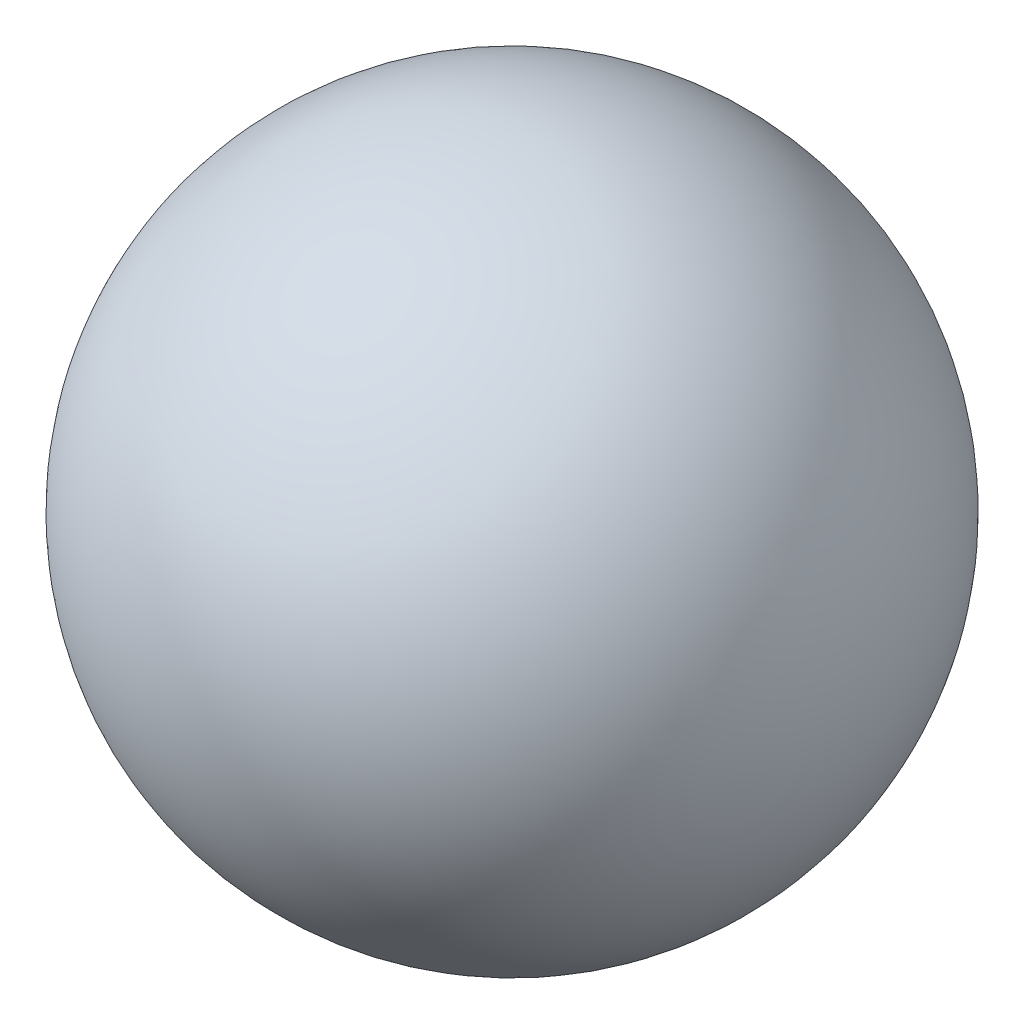
ISO-10303-21;
HEADER;
FILE_DESCRIPTION(('STEP AP214'),'2;1');
FILE_NAME('part.step','',(''),(''),'','','');
FILE_SCHEMA(('AUTOMOTIVE_DESIGN { 1 0 10303 214 1 1 1 1 }'));
ENDSEC;
DATA;
#1=APPLICATION_CONTEXT('core data for automotive mechanical design processes');
#2=APPLICATION_PROTOCOL_DEFINITION('international standard','automotive_design',2000,#1);
#3=PRODUCT_CONTEXT('',#1,'mechanical');
#4=PRODUCT('Part','Part','',(#3));
#5=PRODUCT_RELATED_PRODUCT_CATEGORY('part','',(#4));
#6=PRODUCT_DEFINITION_FORMATION('','',#4);
#7=PRODUCT_DEFINITION_CONTEXT('part definition',#1,'design');
#8=PRODUCT_DEFINITION('design','',#6,#7);
#9=PRODUCT_DEFINITION_SHAPE('','',#8);
#10=(LENGTH_UNIT() NAMED_UNIT(*) SI_UNIT(.MILLI.,.METRE.));
#11=(NAMED_UNIT(*) PLANE_ANGLE_UNIT() SI_UNIT($,.RADIAN.));
#12=(NAMED_UNIT(*) SI_UNIT($,.STERADIAN.) SOLID_ANGLE_UNIT());
#13=UNCERTAINTY_MEASURE_WITH_UNIT(LENGTH_MEASURE(1.E-05),#10,'distance_accuracy_value','');
#14=(GEOMETRIC_REPRESENTATION_CONTEXT(3) GLOBAL_UNCERTAINTY_ASSIGNED_CONTEXT((#13)) GLOBAL_UNIT_ASSIGNED_CONTEXT((#10,
#11,#12)) REPRESENTATION_CONTEXT('',''));
#15=CARTESIAN_POINT('',(0.,0.,0.));
#16=DIRECTION('',(0.,0.,1.));
#17=DIRECTION('',(1.,0.,0.));
#18=AXIS2_PLACEMENT_3D('',#15,#16,#17);
#19=CARTESIAN_POINT('',(0.,0.,0.));
#20=DIRECTION('',(1.,0.,0.));
#21=DIRECTION('',(0.,-1.,0.));
#22=AXIS2_PLACEMENT_3D('',#19,#20,#21);
#23=SPHERICAL_SURFACE('',#22,1809.06577988);
#24=CARTESIAN_POINT('',(1809.06577988,0.,0.));
#25=VERTEX_POINT('',#24);
#26=VERTEX_LOOP('',#25);
#27=FACE_BOUND('',#26,.T.);
#28=ADVANCED_FACE('F33',(#27),#23,.T.);
#29=CLOSED_SHELL('',(#28));
#30=MANIFOLD_SOLID_BREP('B2',#29);
#31=ADVANCED_BREP_SHAPE_REPRESENTATION('',(#18,#30),#14);
#32=SHAPE_DEFINITION_REPRESENTATION(#9,#31);
ENDSEC;
END-ISO-10303-21;
